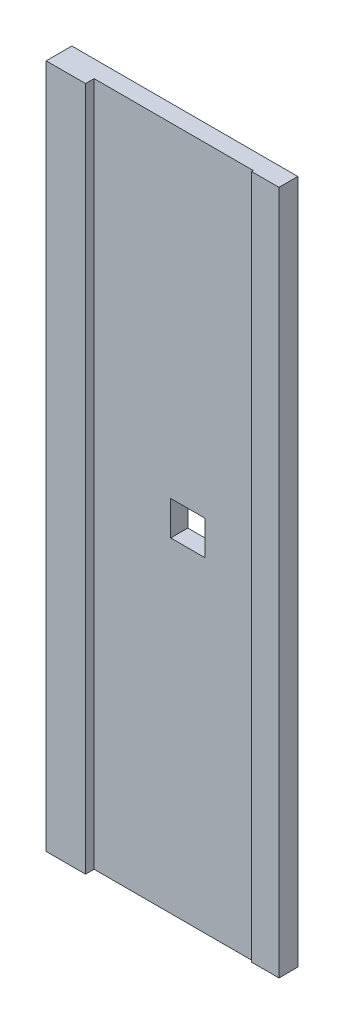
ISO-10303-21;
HEADER;
FILE_DESCRIPTION(('STEP AP214'),'2;1');
FILE_NAME('part.step','',(''),(''),'','','');
FILE_SCHEMA(('AUTOMOTIVE_DESIGN { 1 0 10303 214 1 1 1 1 }'));
ENDSEC;
DATA;
#1=APPLICATION_CONTEXT('core data for automotive mechanical design processes');
#2=APPLICATION_PROTOCOL_DEFINITION('international standard','automotive_design',2000,#1);
#3=PRODUCT_CONTEXT('',#1,'mechanical');
#4=PRODUCT('Part','Part','',(#3));
#5=PRODUCT_RELATED_PRODUCT_CATEGORY('part','',(#4));
#6=PRODUCT_DEFINITION_FORMATION('','',#4);
#7=PRODUCT_DEFINITION_CONTEXT('part definition',#1,'design');
#8=PRODUCT_DEFINITION('design','',#6,#7);
#9=PRODUCT_DEFINITION_SHAPE('','',#8);
#10=(LENGTH_UNIT() NAMED_UNIT(*) SI_UNIT(.MILLI.,.METRE.));
#11=(NAMED_UNIT(*) PLANE_ANGLE_UNIT() SI_UNIT($,.RADIAN.));
#12=(NAMED_UNIT(*) SI_UNIT($,.STERADIAN.) SOLID_ANGLE_UNIT());
#13=UNCERTAINTY_MEASURE_WITH_UNIT(LENGTH_MEASURE(1.E-05),#10,'distance_accuracy_value','');
#14=(GEOMETRIC_REPRESENTATION_CONTEXT(3) GLOBAL_UNCERTAINTY_ASSIGNED_CONTEXT((#13)) GLOBAL_UNIT_ASSIGNED_CONTEXT((#10,
#11,#12)) REPRESENTATION_CONTEXT('',''));
#15=CARTESIAN_POINT('',(0.,0.,0.));
#16=DIRECTION('',(0.,0.,1.));
#17=DIRECTION('',(1.,0.,0.));
#18=AXIS2_PLACEMENT_3D('',#15,#16,#17);
#19=CARTESIAN_POINT('',(0.,0.,10.));
#20=DIRECTION('',(0.,0.,-1.));
#21=DIRECTION('',(-1.,0.,0.));
#22=AXIS2_PLACEMENT_3D('',#19,#20,#21);
#23=PLANE('',#22);
#24=DIRECTION('',(-1.,0.,0.));
#25=VECTOR('',#24,1.);
#26=CARTESIAN_POINT('',(67.75,210.,10.));
#27=LINE('',#26,#25);
#28=CARTESIAN_POINT('',(87.75,210.,10.));
#29=VERTEX_POINT('',#28);
#30=CARTESIAN_POINT('',(67.75,210.,10.));
#31=VERTEX_POINT('',#30);
#32=EDGE_CURVE('E148',#29,#31,#27,.T.);
#33=ORIENTED_EDGE('',*,*,#32,.F.);
#34=DIRECTION('',(0.,1.,0.));
#35=VECTOR('',#34,1.);
#36=CARTESIAN_POINT('',(87.75,190.,10.));
#37=LINE('',#36,#35);
#38=CARTESIAN_POINT('',(87.75,190.,10.));
#39=VERTEX_POINT('',#38);
#40=EDGE_CURVE('E47',#39,#29,#37,.T.);
#41=ORIENTED_EDGE('',*,*,#40,.F.);
#42=DIRECTION('',(1.,0.,0.));
#43=VECTOR('',#42,1.);
#44=CARTESIAN_POINT('',(67.75,190.,10.));
#45=LINE('',#44,#43);
#46=CARTESIAN_POINT('',(67.75,190.,10.));
#47=VERTEX_POINT('',#46);
#48=EDGE_CURVE('E139',#47,#39,#45,.T.);
#49=ORIENTED_EDGE('',*,*,#48,.F.);
#50=DIRECTION('',(0.,-1.,0.));
#51=VECTOR('',#50,1.);
#52=CARTESIAN_POINT('',(67.75,190.,10.));
#53=LINE('',#52,#51);
#54=EDGE_CURVE('E142',#31,#47,#53,.T.);
#55=ORIENTED_EDGE('',*,*,#54,.F.);
#56=EDGE_LOOP('',(#33,#41,#49,#55));
#57=FACE_BOUND('',#56,.T.);
#58=DIRECTION('',(0.,-1.,0.));
#59=VECTOR('',#58,1.);
#60=CARTESIAN_POINT('',(116.,400.,10.));
#61=LINE('',#60,#59);
#62=CARTESIAN_POINT('',(116.,400.,10.));
#63=VERTEX_POINT('',#62);
#64=CARTESIAN_POINT('',(116.,0.,10.));
#65=VERTEX_POINT('',#64);
#66=EDGE_CURVE('E154',#63,#65,#61,.T.);
#67=ORIENTED_EDGE('',*,*,#66,.F.);
#68=DIRECTION('',(-1.,0.,0.));
#69=VECTOR('',#68,1.);
#70=CARTESIAN_POINT('',(0.,400.,10.));
#71=LINE('',#70,#69);
#72=CARTESIAN_POINT('',(23.,400.,10.));
#73=VERTEX_POINT('',#72);
#74=EDGE_CURVE('E198',#63,#73,#71,.T.);
#75=ORIENTED_EDGE('',*,*,#74,.T.);
#76=DIRECTION('',(0.,1.,0.));
#77=VECTOR('',#76,1.);
#78=CARTESIAN_POINT('',(23.,400.,10.));
#79=LINE('',#78,#77);
#80=CARTESIAN_POINT('',(23.,0.,10.));
#81=VERTEX_POINT('',#80);
#82=EDGE_CURVE('E176',#81,#73,#79,.T.);
#83=ORIENTED_EDGE('',*,*,#82,.F.);
#84=DIRECTION('',(1.,0.,0.));
#85=VECTOR('',#84,1.);
#86=CARTESIAN_POINT('',(0.,0.,10.));
#87=LINE('',#86,#85);
#88=EDGE_CURVE('E196',#81,#65,#87,.T.);
#89=ORIENTED_EDGE('',*,*,#88,.T.);
#90=EDGE_LOOP('',(#67,#75,#83,#89));
#91=FACE_BOUND('',#90,.T.);
#92=ADVANCED_FACE('F32',(#57,#91),#23,.F.);
#93=CARTESIAN_POINT('',(0.,0.,10.));
#94=DIRECTION('',(1.,0.,0.));
#95=DIRECTION('',(0.,0.,-1.));
#96=AXIS2_PLACEMENT_3D('',#93,#94,#95);
#97=PLANE('',#96);
#98=DIRECTION('',(0.,-1.,0.));
#99=VECTOR('',#98,1.);
#100=CARTESIAN_POINT('',(0.,0.,0.));
#101=LINE('',#100,#99);
#102=CARTESIAN_POINT('',(0.,400.,0.));
#103=VERTEX_POINT('',#102);
#104=CARTESIAN_POINT('',(0.,0.,0.));
#105=VERTEX_POINT('',#104);
#106=EDGE_CURVE('E195',#103,#105,#101,.T.);
#107=ORIENTED_EDGE('',*,*,#106,.T.);
#108=DIRECTION('',(0.,0.,-1.));
#109=VECTOR('',#108,1.);
#110=CARTESIAN_POINT('',(0.,0.,10.));
#111=LINE('',#110,#109);
#112=CARTESIAN_POINT('',(0.,0.,15.));
#113=VERTEX_POINT('',#112);
#114=EDGE_CURVE('E11',#113,#105,#111,.T.);
#115=ORIENTED_EDGE('',*,*,#114,.F.);
#116=DIRECTION('',(0.,-1.,0.));
#117=VECTOR('',#116,1.);
#118=CARTESIAN_POINT('',(0.,400.,15.));
#119=LINE('',#118,#117);
#120=CARTESIAN_POINT('',(0.,400.,15.));
#121=VERTEX_POINT('',#120);
#122=EDGE_CURVE('E177',#121,#113,#119,.T.);
#123=ORIENTED_EDGE('',*,*,#122,.F.);
#124=DIRECTION('',(0.,0.,-1.));
#125=VECTOR('',#124,1.);
#126=CARTESIAN_POINT('',(0.,400.,10.));
#127=LINE('',#126,#125);
#128=EDGE_CURVE('E201',#121,#103,#127,.T.);
#129=ORIENTED_EDGE('',*,*,#128,.T.);
#130=EDGE_LOOP('',(#107,#115,#123,#129));
#131=FACE_BOUND('',#130,.T.);
#132=ADVANCED_FACE('F34',(#131),#97,.F.);
#133=CARTESIAN_POINT('',(0.,0.,10.));
#134=DIRECTION('',(0.,1.,0.));
#135=DIRECTION('',(0.,0.,1.));
#136=AXIS2_PLACEMENT_3D('',#133,#134,#135);
#137=PLANE('',#136);
#138=DIRECTION('',(1.,0.,0.));
#139=VECTOR('',#138,1.);
#140=CARTESIAN_POINT('',(0.,0.,0.));
#141=LINE('',#140,#139);
#142=CARTESIAN_POINT('',(132.,0.,0.));
#143=VERTEX_POINT('',#142);
#144=EDGE_CURVE('E204',#105,#143,#141,.T.);
#145=ORIENTED_EDGE('',*,*,#144,.T.);
#146=DIRECTION('',(0.,0.,-1.));
#147=VECTOR('',#146,1.);
#148=CARTESIAN_POINT('',(132.,0.,10.));
#149=LINE('',#148,#147);
#150=CARTESIAN_POINT('',(132.,0.,11.));
#151=VERTEX_POINT('',#150);
#152=EDGE_CURVE('E40',#151,#143,#149,.T.);
#153=ORIENTED_EDGE('',*,*,#152,.F.);
#154=DIRECTION('',(1.,0.,0.));
#155=VECTOR('',#154,1.);
#156=CARTESIAN_POINT('',(132.,0.,11.));
#157=LINE('',#156,#155);
#158=CARTESIAN_POINT('',(116.,0.,11.));
#159=VERTEX_POINT('',#158);
#160=EDGE_CURVE('E165',#159,#151,#157,.T.);
#161=ORIENTED_EDGE('',*,*,#160,.F.);
#162=DIRECTION('',(0.,0.,-1.));
#163=VECTOR('',#162,1.);
#164=CARTESIAN_POINT('',(116.,0.,11.));
#165=LINE('',#164,#163);
#166=EDGE_CURVE('E168',#159,#65,#165,.T.);
#167=ORIENTED_EDGE('',*,*,#166,.T.);
#168=ORIENTED_EDGE('',*,*,#88,.F.);
#169=DIRECTION('',(0.,0.,-1.));
#170=VECTOR('',#169,1.);
#171=CARTESIAN_POINT('',(23.,0.,15.));
#172=LINE('',#171,#170);
#173=CARTESIAN_POINT('',(23.,0.,15.));
#174=VERTEX_POINT('',#173);
#175=EDGE_CURVE('E192',#174,#81,#172,.T.);
#176=ORIENTED_EDGE('',*,*,#175,.F.);
#177=DIRECTION('',(1.,0.,0.));
#178=VECTOR('',#177,1.);
#179=CARTESIAN_POINT('',(0.,0.,15.));
#180=LINE('',#179,#178);
#181=EDGE_CURVE('E180',#113,#174,#180,.T.);
#182=ORIENTED_EDGE('',*,*,#181,.F.);
#183=ORIENTED_EDGE('',*,*,#114,.T.);
#184=EDGE_LOOP('',(#145,#153,#161,#167,#168,#176,#182,#183));
#185=FACE_BOUND('',#184,.T.);
#186=ADVANCED_FACE('F240',(#185),#137,.F.);
#187=CARTESIAN_POINT('',(132.,0.,10.));
#188=DIRECTION('',(-1.,0.,0.));
#189=DIRECTION('',(0.,0.,1.));
#190=AXIS2_PLACEMENT_3D('',#187,#188,#189);
#191=PLANE('',#190);
#192=DIRECTION('',(0.,1.,0.));
#193=VECTOR('',#192,1.);
#194=CARTESIAN_POINT('',(132.,0.,0.));
#195=LINE('',#194,#193);
#196=CARTESIAN_POINT('',(132.,400.,0.));
#197=VERTEX_POINT('',#196);
#198=EDGE_CURVE('E206',#143,#197,#195,.T.);
#199=ORIENTED_EDGE('',*,*,#198,.T.);
#200=DIRECTION('',(0.,0.,-1.));
#201=VECTOR('',#200,1.);
#202=CARTESIAN_POINT('',(132.,400.,10.));
#203=LINE('',#202,#201);
#204=CARTESIAN_POINT('',(132.,400.,11.));
#205=VERTEX_POINT('',#204);
#206=EDGE_CURVE('E211',#205,#197,#203,.T.);
#207=ORIENTED_EDGE('',*,*,#206,.F.);
#208=DIRECTION('',(0.,1.,0.));
#209=VECTOR('',#208,1.);
#210=CARTESIAN_POINT('',(132.,400.,11.));
#211=LINE('',#210,#209);
#212=EDGE_CURVE('E158',#151,#205,#211,.T.);
#213=ORIENTED_EDGE('',*,*,#212,.F.);
#214=ORIENTED_EDGE('',*,*,#152,.T.);
#215=EDGE_LOOP('',(#199,#207,#213,#214));
#216=FACE_BOUND('',#215,.T.);
#217=ADVANCED_FACE('F217',(#216),#191,.F.);
#218=CARTESIAN_POINT('',(0.,400.,10.));
#219=DIRECTION('',(0.,-1.,0.));
#220=DIRECTION('',(0.,0.,-1.));
#221=AXIS2_PLACEMENT_3D('',#218,#219,#220);
#222=PLANE('',#221);
#223=DIRECTION('',(-1.,0.,0.));
#224=VECTOR('',#223,1.);
#225=CARTESIAN_POINT('',(0.,400.,0.));
#226=LINE('',#225,#224);
#227=EDGE_CURVE('E199',#197,#103,#226,.T.);
#228=ORIENTED_EDGE('',*,*,#227,.T.);
#229=ORIENTED_EDGE('',*,*,#128,.F.);
#230=DIRECTION('',(-1.,0.,0.));
#231=VECTOR('',#230,1.);
#232=CARTESIAN_POINT('',(0.,400.,15.));
#233=LINE('',#232,#231);
#234=CARTESIAN_POINT('',(23.,400.,15.));
#235=VERTEX_POINT('',#234);
#236=EDGE_CURVE('E184',#235,#121,#233,.T.);
#237=ORIENTED_EDGE('',*,*,#236,.F.);
#238=DIRECTION('',(0.,0.,-1.));
#239=VECTOR('',#238,1.);
#240=CARTESIAN_POINT('',(23.,400.,15.));
#241=LINE('',#240,#239);
#242=EDGE_CURVE('E187',#235,#73,#241,.T.);
#243=ORIENTED_EDGE('',*,*,#242,.T.);
#244=ORIENTED_EDGE('',*,*,#74,.F.);
#245=DIRECTION('',(0.,0.,-1.));
#246=VECTOR('',#245,1.);
#247=CARTESIAN_POINT('',(116.,400.,11.));
#248=LINE('',#247,#246);
#249=CARTESIAN_POINT('',(116.,400.,11.));
#250=VERTEX_POINT('',#249);
#251=EDGE_CURVE('E173',#250,#63,#248,.T.);
#252=ORIENTED_EDGE('',*,*,#251,.F.);
#253=DIRECTION('',(-1.,0.,0.));
#254=VECTOR('',#253,1.);
#255=CARTESIAN_POINT('',(132.,400.,11.));
#256=LINE('',#255,#254);
#257=EDGE_CURVE('E161',#205,#250,#256,.T.);
#258=ORIENTED_EDGE('',*,*,#257,.F.);
#259=ORIENTED_EDGE('',*,*,#206,.T.);
#260=EDGE_LOOP('',(#228,#229,#237,#243,#244,#252,#258,#259));
#261=FACE_BOUND('',#260,.T.);
#262=ADVANCED_FACE('F223',(#261),#222,.F.);
#263=CARTESIAN_POINT('',(0.,0.,0.));
#264=DIRECTION('',(0.,0.,-1.));
#265=DIRECTION('',(-1.,0.,0.));
#266=AXIS2_PLACEMENT_3D('',#263,#264,#265);
#267=PLANE('',#266);
#268=DIRECTION('',(0.,1.,0.));
#269=VECTOR('',#268,1.);
#270=CARTESIAN_POINT('',(87.75,190.,0.));
#271=LINE('',#270,#269);
#272=CARTESIAN_POINT('',(87.75,190.,0.));
#273=VERTEX_POINT('',#272);
#274=CARTESIAN_POINT('',(87.75,210.,0.));
#275=VERTEX_POINT('',#274);
#276=EDGE_CURVE('E123',#273,#275,#271,.T.);
#277=ORIENTED_EDGE('',*,*,#276,.T.);
#278=DIRECTION('',(-1.,0.,0.));
#279=VECTOR('',#278,1.);
#280=CARTESIAN_POINT('',(67.75,210.,0.));
#281=LINE('',#280,#279);
#282=CARTESIAN_POINT('',(67.75,210.,0.));
#283=VERTEX_POINT('',#282);
#284=EDGE_CURVE('E132',#275,#283,#281,.T.);
#285=ORIENTED_EDGE('',*,*,#284,.T.);
#286=DIRECTION('',(0.,-1.,0.));
#287=VECTOR('',#286,1.);
#288=CARTESIAN_POINT('',(67.75,190.,0.));
#289=LINE('',#288,#287);
#290=CARTESIAN_POINT('',(67.75,190.,0.));
#291=VERTEX_POINT('',#290);
#292=EDGE_CURVE('E55',#283,#291,#289,.T.);
#293=ORIENTED_EDGE('',*,*,#292,.T.);
#294=DIRECTION('',(1.,0.,0.));
#295=VECTOR('',#294,1.);
#296=CARTESIAN_POINT('',(67.75,190.,0.));
#297=LINE('',#296,#295);
#298=EDGE_CURVE('E129',#291,#273,#297,.T.);
#299=ORIENTED_EDGE('',*,*,#298,.T.);
#300=EDGE_LOOP('',(#277,#285,#293,#299));
#301=FACE_BOUND('',#300,.T.);
#302=ORIENTED_EDGE('',*,*,#106,.F.);
#303=ORIENTED_EDGE('',*,*,#227,.F.);
#304=ORIENTED_EDGE('',*,*,#198,.F.);
#305=ORIENTED_EDGE('',*,*,#144,.F.);
#306=EDGE_LOOP('',(#302,#303,#304,#305));
#307=FACE_BOUND('',#306,.T.);
#308=ADVANCED_FACE('F136',(#301,#307),#267,.T.);
#309=CARTESIAN_POINT('',(23.,400.,15.));
#310=DIRECTION('',(-1.,0.,0.));
#311=DIRECTION('',(0.,-1.,0.));
#312=AXIS2_PLACEMENT_3D('',#309,#310,#311);
#313=PLANE('',#312);
#314=ORIENTED_EDGE('',*,*,#82,.T.);
#315=ORIENTED_EDGE('',*,*,#242,.F.);
#316=DIRECTION('',(0.,1.,0.));
#317=VECTOR('',#316,1.);
#318=CARTESIAN_POINT('',(23.,400.,15.));
#319=LINE('',#318,#317);
#320=EDGE_CURVE('E182',#174,#235,#319,.T.);
#321=ORIENTED_EDGE('',*,*,#320,.F.);
#322=ORIENTED_EDGE('',*,*,#175,.T.);
#323=EDGE_LOOP('',(#314,#315,#321,#322));
#324=FACE_BOUND('',#323,.T.);
#325=ADVANCED_FACE('F237',(#324),#313,.F.);
#326=CARTESIAN_POINT('',(0.,0.,15.));
#327=DIRECTION('',(0.,0.,1.));
#328=DIRECTION('',(1.,0.,0.));
#329=AXIS2_PLACEMENT_3D('',#326,#327,#328);
#330=PLANE('',#329);
#331=ORIENTED_EDGE('',*,*,#122,.T.);
#332=ORIENTED_EDGE('',*,*,#181,.T.);
#333=ORIENTED_EDGE('',*,*,#320,.T.);
#334=ORIENTED_EDGE('',*,*,#236,.T.);
#335=EDGE_LOOP('',(#331,#332,#333,#334));
#336=FACE_BOUND('',#335,.T.);
#337=ADVANCED_FACE('F230',(#336),#330,.T.);
#338=CARTESIAN_POINT('',(116.,400.,11.));
#339=DIRECTION('',(1.,0.,0.));
#340=DIRECTION('',(0.,1.,0.));
#341=AXIS2_PLACEMENT_3D('',#338,#339,#340);
#342=PLANE('',#341);
#343=ORIENTED_EDGE('',*,*,#66,.T.);
#344=ORIENTED_EDGE('',*,*,#166,.F.);
#345=DIRECTION('',(0.,-1.,0.));
#346=VECTOR('',#345,1.);
#347=CARTESIAN_POINT('',(116.,400.,11.));
#348=LINE('',#347,#346);
#349=EDGE_CURVE('E163',#250,#159,#348,.T.);
#350=ORIENTED_EDGE('',*,*,#349,.F.);
#351=ORIENTED_EDGE('',*,*,#251,.T.);
#352=EDGE_LOOP('',(#343,#344,#350,#351));
#353=FACE_BOUND('',#352,.T.);
#354=ADVANCED_FACE('F244',(#353),#342,.F.);
#355=CARTESIAN_POINT('',(0.,0.,11.));
#356=DIRECTION('',(0.,0.,-1.));
#357=DIRECTION('',(-1.,0.,0.));
#358=AXIS2_PLACEMENT_3D('',#355,#356,#357);
#359=PLANE('',#358);
#360=ORIENTED_EDGE('',*,*,#212,.T.);
#361=ORIENTED_EDGE('',*,*,#257,.T.);
#362=ORIENTED_EDGE('',*,*,#349,.T.);
#363=ORIENTED_EDGE('',*,*,#160,.T.);
#364=EDGE_LOOP('',(#360,#361,#362,#363));
#365=FACE_BOUND('',#364,.T.);
#366=ADVANCED_FACE('F246',(#365),#359,.F.);
#367=CARTESIAN_POINT('',(87.75,190.,0.));
#368=DIRECTION('',(1.,0.,0.));
#369=DIRECTION('',(0.,0.,-1.));
#370=AXIS2_PLACEMENT_3D('',#367,#368,#369);
#371=PLANE('',#370);
#372=ORIENTED_EDGE('',*,*,#40,.T.);
#373=DIRECTION('',(0.,0.,1.));
#374=VECTOR('',#373,1.);
#375=CARTESIAN_POINT('',(87.75,210.,0.));
#376=LINE('',#375,#374);
#377=EDGE_CURVE('E119',#275,#29,#376,.T.);
#378=ORIENTED_EDGE('',*,*,#377,.F.);
#379=ORIENTED_EDGE('',*,*,#276,.F.);
#380=DIRECTION('',(0.,0.,1.));
#381=VECTOR('',#380,1.);
#382=CARTESIAN_POINT('',(87.75,190.,0.));
#383=LINE('',#382,#381);
#384=EDGE_CURVE('E152',#273,#39,#383,.T.);
#385=ORIENTED_EDGE('',*,*,#384,.T.);
#386=EDGE_LOOP('',(#372,#378,#379,#385));
#387=FACE_BOUND('',#386,.T.);
#388=ADVANCED_FACE('F121',(#387),#371,.F.);
#389=CARTESIAN_POINT('',(67.75,190.,0.));
#390=DIRECTION('',(0.,-1.,0.));
#391=DIRECTION('',(0.,0.,-1.));
#392=AXIS2_PLACEMENT_3D('',#389,#390,#391);
#393=PLANE('',#392);
#394=ORIENTED_EDGE('',*,*,#48,.T.);
#395=ORIENTED_EDGE('',*,*,#384,.F.);
#396=ORIENTED_EDGE('',*,*,#298,.F.);
#397=DIRECTION('',(0.,0.,1.));
#398=VECTOR('',#397,1.);
#399=CARTESIAN_POINT('',(67.75,190.,0.));
#400=LINE('',#399,#398);
#401=EDGE_CURVE('E155',#291,#47,#400,.T.);
#402=ORIENTED_EDGE('',*,*,#401,.T.);
#403=EDGE_LOOP('',(#394,#395,#396,#402));
#404=FACE_BOUND('',#403,.T.);
#405=ADVANCED_FACE('F253',(#404),#393,.F.);
#406=CARTESIAN_POINT('',(67.75,190.,0.));
#407=DIRECTION('',(-1.,0.,0.));
#408=DIRECTION('',(0.,0.,1.));
#409=AXIS2_PLACEMENT_3D('',#406,#407,#408);
#410=PLANE('',#409);
#411=ORIENTED_EDGE('',*,*,#54,.T.);
#412=ORIENTED_EDGE('',*,*,#401,.F.);
#413=ORIENTED_EDGE('',*,*,#292,.F.);
#414=DIRECTION('',(0.,0.,1.));
#415=VECTOR('',#414,1.);
#416=CARTESIAN_POINT('',(67.75,210.,0.));
#417=LINE('',#416,#415);
#418=EDGE_CURVE('E128',#283,#31,#417,.T.);
#419=ORIENTED_EDGE('',*,*,#418,.T.);
#420=EDGE_LOOP('',(#411,#412,#413,#419));
#421=FACE_BOUND('',#420,.T.);
#422=ADVANCED_FACE('F358',(#421),#410,.F.);
#423=CARTESIAN_POINT('',(67.75,210.,0.));
#424=DIRECTION('',(0.,1.,0.));
#425=DIRECTION('',(0.,0.,1.));
#426=AXIS2_PLACEMENT_3D('',#423,#424,#425);
#427=PLANE('',#426);
#428=ORIENTED_EDGE('',*,*,#32,.T.);
#429=ORIENTED_EDGE('',*,*,#418,.F.);
#430=ORIENTED_EDGE('',*,*,#284,.F.);
#431=ORIENTED_EDGE('',*,*,#377,.T.);
#432=EDGE_LOOP('',(#428,#429,#430,#431));
#433=FACE_BOUND('',#432,.T.);
#434=ADVANCED_FACE('F133',(#433),#427,.F.);
#435=CLOSED_SHELL('',(#92,#132,#186,#217,#262,#308,#325,#337,#354,#366,#388,#405,#422,#434));
#436=MANIFOLD_SOLID_BREP('B2',#435);
#437=ADVANCED_BREP_SHAPE_REPRESENTATION('',(#18,#436),#14);
#438=SHAPE_DEFINITION_REPRESENTATION(#9,#437);
ENDSEC;
END-ISO-10303-21;
